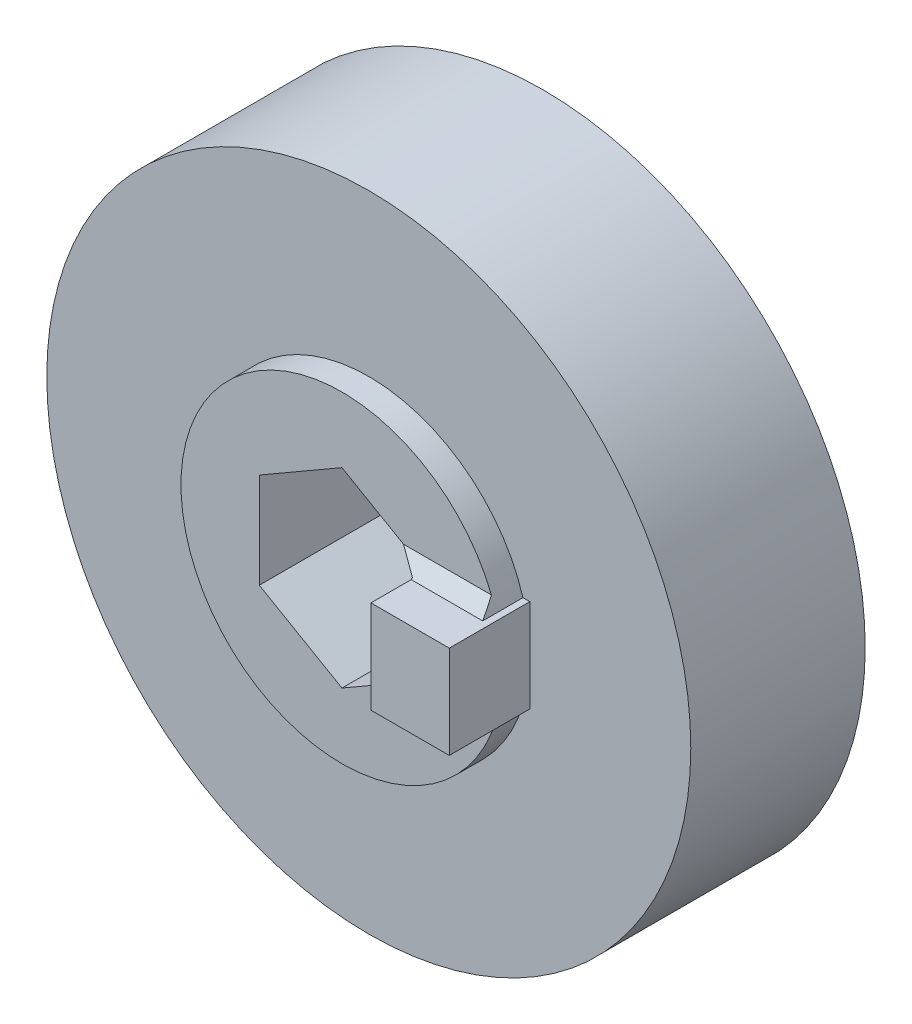
ISO-10303-21;
HEADER;
FILE_DESCRIPTION(('STEP AP214'),'2;1');
FILE_NAME('part.step','',(''),(''),'','','');
FILE_SCHEMA(('AUTOMOTIVE_DESIGN { 1 0 10303 214 1 1 1 1 }'));
ENDSEC;
DATA;
#1=APPLICATION_CONTEXT('core data for automotive mechanical design processes');
#2=APPLICATION_PROTOCOL_DEFINITION('international standard','automotive_design',2000,#1);
#3=PRODUCT_CONTEXT('',#1,'mechanical');
#4=PRODUCT('Part','Part','',(#3));
#5=PRODUCT_RELATED_PRODUCT_CATEGORY('part','',(#4));
#6=PRODUCT_DEFINITION_FORMATION('','',#4);
#7=PRODUCT_DEFINITION_CONTEXT('part definition',#1,'design');
#8=PRODUCT_DEFINITION('design','',#6,#7);
#9=PRODUCT_DEFINITION_SHAPE('','',#8);
#10=(LENGTH_UNIT() NAMED_UNIT(*) SI_UNIT(.MILLI.,.METRE.));
#11=(NAMED_UNIT(*) PLANE_ANGLE_UNIT() SI_UNIT($,.RADIAN.));
#12=(NAMED_UNIT(*) SI_UNIT($,.STERADIAN.) SOLID_ANGLE_UNIT());
#13=UNCERTAINTY_MEASURE_WITH_UNIT(LENGTH_MEASURE(1.E-05),#10,'distance_accuracy_value','');
#14=(GEOMETRIC_REPRESENTATION_CONTEXT(3) GLOBAL_UNCERTAINTY_ASSIGNED_CONTEXT((#13)) GLOBAL_UNIT_ASSIGNED_CONTEXT((#10,
#11,#12)) REPRESENTATION_CONTEXT('',''));
#15=CARTESIAN_POINT('',(0.,0.,0.));
#16=DIRECTION('',(0.,0.,1.));
#17=DIRECTION('',(1.,0.,0.));
#18=AXIS2_PLACEMENT_3D('',#15,#16,#17);
#19=CARTESIAN_POINT('',(3.08,0.,28.8811915483254));
#20=DIRECTION('',(-1.,0.,0.));
#21=DIRECTION('',(0.,0.,1.));
#22=AXIS2_PLACEMENT_3D('',#19,#20,#21);
#23=PLANE('',#22);
#24=DIRECTION('',(0.,0.,-1.));
#25=VECTOR('',#24,1.);
#26=CARTESIAN_POINT('',(3.08,1.77823882910405,28.8811915483254));
#27=LINE('',#26,#25);
#28=CARTESIAN_POINT('',(3.08,1.77823882910405,0.453811978464832));
#29=VERTEX_POINT('',#28);
#30=CARTESIAN_POINT('',(3.08,1.77823882910405,-6.));
#31=VERTEX_POINT('',#30);
#32=EDGE_CURVE('E77',#29,#31,#27,.T.);
#33=ORIENTED_EDGE('',*,*,#32,.T.);
#34=DIRECTION('',(0.,1.,0.));
#35=VECTOR('',#34,1.);
#36=CARTESIAN_POINT('',(3.08,-1.77823882910405,-6.));
#37=LINE('',#36,#35);
#38=CARTESIAN_POINT('',(3.08,-1.77823882910405,-6.));
#39=VERTEX_POINT('',#38);
#40=EDGE_CURVE('E167',#39,#31,#37,.T.);
#41=ORIENTED_EDGE('',*,*,#40,.F.);
#42=DIRECTION('',(0.,0.,1.));
#43=VECTOR('',#42,1.);
#44=CARTESIAN_POINT('',(3.08,-1.77823882910405,-6.));
#45=LINE('',#44,#43);
#46=CARTESIAN_POINT('',(3.08,-1.77823882910405,0.));
#47=VERTEX_POINT('',#46);
#48=EDGE_CURVE('E157',#39,#47,#45,.T.);
#49=ORIENTED_EDGE('',*,*,#48,.T.);
#50=DIRECTION('',(0.,1.,0.));
#51=VECTOR('',#50,1.);
#52=CARTESIAN_POINT('',(3.08,-1.77823882910405,0.));
#53=LINE('',#52,#51);
#54=CARTESIAN_POINT('',(3.08,-1.73205080756887,0.));
#55=VERTEX_POINT('',#54);
#56=EDGE_CURVE('E199',#47,#55,#53,.T.);
#57=ORIENTED_EDGE('',*,*,#56,.T.);
#58=DIRECTION('',(0.,0.,-1.));
#59=VECTOR('',#58,1.);
#60=CARTESIAN_POINT('',(3.08,-1.73205080756887,0.));
#61=LINE('',#60,#59);
#62=CARTESIAN_POINT('',(3.08,-1.73205080756887,2.));
#63=VERTEX_POINT('',#62);
#64=EDGE_CURVE('E270',#63,#55,#61,.T.);
#65=ORIENTED_EDGE('',*,*,#64,.F.);
#66=DIRECTION('',(0.,-1.,0.));
#67=VECTOR('',#66,1.);
#68=CARTESIAN_POINT('',(3.08,-1.73205080756887,2.));
#69=LINE('',#68,#67);
#70=CARTESIAN_POINT('',(3.08,1.73205080756887,2.));
#71=VERTEX_POINT('',#70);
#72=EDGE_CURVE('E228',#71,#63,#69,.T.);
#73=ORIENTED_EDGE('',*,*,#72,.F.);
#74=DIRECTION('',(0.,0.,-1.));
#75=VECTOR('',#74,1.);
#76=CARTESIAN_POINT('',(3.08,1.73205080756887,2.));
#77=LINE('',#76,#75);
#78=CARTESIAN_POINT('',(3.08,1.73205080756887,0.5));
#79=VERTEX_POINT('',#78);
#80=EDGE_CURVE('E232',#71,#79,#77,.T.);
#81=ORIENTED_EDGE('',*,*,#80,.T.);
#82=DIRECTION('',(0.,0.707106781186548,-0.707106781186548));
#83=VECTOR('',#82,1.);
#84=CARTESIAN_POINT('',(3.08,-13.3245703703783,15.5566211779472));
#85=LINE('',#84,#83);
#86=EDGE_CURVE('E281',#29,#79,#85,.F.);
#87=ORIENTED_EDGE('',*,*,#86,.F.);
#88=EDGE_LOOP('',(#33,#41,#49,#57,#65,#73,#81,#87));
#89=FACE_BOUND('',#88,.T.);
#90=ADVANCED_FACE('F52',(#89),#23,.T.);
#91=CARTESIAN_POINT('',(0.,0.,-1.));
#92=DIRECTION('',(0.,0.,1.));
#93=DIRECTION('',(1.,0.,0.));
#94=AXIS2_PLACEMENT_3D('',#91,#92,#93);
#95=CYLINDRICAL_SURFACE('',#94,6.);
#96=DIRECTION('',(0.,0.,1.));
#97=VECTOR('',#96,1.);
#98=CARTESIAN_POINT('',(5.74456264653803,1.73205080756887,-1.));
#99=LINE('',#98,#97);
#100=CARTESIAN_POINT('',(5.74456264653803,1.73205080756887,-1.));
#101=VERTEX_POINT('',#100);
#102=CARTESIAN_POINT('',(5.74456264653803,1.73205080756887,0.5));
#103=VERTEX_POINT('',#102);
#104=EDGE_CURVE('E375',#101,#103,#99,.T.);
#105=ORIENTED_EDGE('',*,*,#104,.F.);
#106=CARTESIAN_POINT('',(0.,0.,-1.));
#107=DIRECTION('',(0.,0.,-1.));
#108=DIRECTION('',(1.,0.,0.));
#109=AXIS2_PLACEMENT_3D('',#106,#107,#108);
#110=CIRCLE('',#109,6.);
#111=CARTESIAN_POINT('',(5.74456264653803,-1.73205080756887,-1.));
#112=VERTEX_POINT('',#111);
#113=EDGE_CURVE('E245',#112,#101,#110,.T.);
#114=ORIENTED_EDGE('',*,*,#113,.F.);
#115=DIRECTION('',(0.,0.,1.));
#116=VECTOR('',#115,1.);
#117=CARTESIAN_POINT('',(5.74456264653803,-1.73205080756887,-1.));
#118=LINE('',#117,#116);
#119=CARTESIAN_POINT('',(5.74456264653803,-1.73205080756887,0.));
#120=VERTEX_POINT('',#119);
#121=EDGE_CURVE('E261',#112,#120,#118,.T.);
#122=ORIENTED_EDGE('',*,*,#121,.T.);
#123=CARTESIAN_POINT('',(0.,0.,0.));
#124=DIRECTION('',(0.,0.,-1.));
#125=DIRECTION('',(1.,0.,0.));
#126=AXIS2_PLACEMENT_3D('',#123,#124,#125);
#127=CIRCLE('',#126,6.);
#128=CARTESIAN_POINT('',(5.56937601463855,2.23205080756887,0.));
#129=VERTEX_POINT('',#128);
#130=EDGE_CURVE('E241',#120,#129,#127,.T.);
#131=ORIENTED_EDGE('',*,*,#130,.T.);
#132=CARTESIAN_POINT('',(0.,0.,2.23205080756888));
#133=DIRECTION('',(0.,0.707106781186548,0.707106781186548));
#134=DIRECTION('',(0.,-0.707106781186548,0.707106781186548));
#135=AXIS2_PLACEMENT_3D('',#132,#133,#134);
#136=ELLIPSE('',#135,8.48528137423857,6.);
#137=EDGE_CURVE('E62',#129,#103,#136,.F.);
#138=ORIENTED_EDGE('',*,*,#137,.T.);
#139=EDGE_LOOP('',(#105,#114,#122,#131,#138));
#140=FACE_BOUND('',#139,.T.);
#141=ADVANCED_FACE('F54',(#140),#95,.T.);
#142=CARTESIAN_POINT('',(1.54,2.66735824365607,28.8811915483254));
#143=DIRECTION('',(-0.5,-0.866025403784439,0.));
#144=DIRECTION('',(0.866025403784439,-0.5,0.));
#145=AXIS2_PLACEMENT_3D('',#142,#143,#144);
#146=PLANE('',#145);
#147=DIRECTION('',(0.774596669241483,-0.447213595499958,0.447213595499958));
#148=VECTOR('',#147,1.);
#149=CARTESIAN_POINT('',(3.964,1.26786119114042,0.96418961642846));
#150=LINE('',#149,#148);
#151=CARTESIAN_POINT('',(2.29397459621557,2.23205080756887,0.));
#152=VERTEX_POINT('',#151);
#153=EDGE_CURVE('E284',#29,#152,#150,.F.);
#154=ORIENTED_EDGE('',*,*,#153,.T.);
#155=DIRECTION('',(-0.866025403784439,0.5,0.));
#156=VECTOR('',#155,1.);
#157=CARTESIAN_POINT('',(1.54,2.66735824365607,0.));
#158=LINE('',#157,#156);
#159=CARTESIAN_POINT('',(0.,3.55647765820809,0.));
#160=VERTEX_POINT('',#159);
#161=EDGE_CURVE('E12',#152,#160,#158,.T.);
#162=ORIENTED_EDGE('',*,*,#161,.T.);
#163=DIRECTION('',(0.,0.,1.));
#164=VECTOR('',#163,1.);
#165=CARTESIAN_POINT('',(0.,3.55647765820809,-6.));
#166=LINE('',#165,#164);
#167=CARTESIAN_POINT('',(0.,3.55647765820809,-6.));
#168=VERTEX_POINT('',#167);
#169=EDGE_CURVE('E212',#168,#160,#166,.T.);
#170=ORIENTED_EDGE('',*,*,#169,.F.);
#171=DIRECTION('',(-0.866025403784439,0.5,0.));
#172=VECTOR('',#171,1.);
#173=CARTESIAN_POINT('',(3.08,1.77823882910405,-6.));
#174=LINE('',#173,#172);
#175=EDGE_CURVE('E185',#31,#168,#174,.T.);
#176=ORIENTED_EDGE('',*,*,#175,.F.);
#177=ORIENTED_EDGE('',*,*,#32,.F.);
#178=EDGE_LOOP('',(#154,#162,#170,#176,#177));
#179=FACE_BOUND('',#178,.T.);
#180=ADVANCED_FACE('F645',(#179),#146,.T.);
#181=CARTESIAN_POINT('',(4.5,1.73205080756887,0.5));
#182=DIRECTION('',(0.,0.707106781186548,0.707106781186548));
#183=DIRECTION('',(1.,0.,0.));
#184=AXIS2_PLACEMENT_3D('',#181,#182,#183);
#185=PLANE('',#184);
#186=DIRECTION('',(1.,0.,0.));
#187=VECTOR('',#186,1.);
#188=CARTESIAN_POINT('',(5.74456264653803,2.23205080756887,0.));
#189=LINE('',#188,#187);
#190=EDGE_CURVE('E290',#152,#129,#189,.T.);
#191=ORIENTED_EDGE('',*,*,#190,.F.);
#192=ORIENTED_EDGE('',*,*,#153,.F.);
#193=ORIENTED_EDGE('',*,*,#86,.T.);
#194=DIRECTION('',(-1.,0.,0.));
#195=VECTOR('',#194,1.);
#196=CARTESIAN_POINT('',(3.,1.73205080756887,0.5));
#197=LINE('',#196,#195);
#198=EDGE_CURVE('E278',#103,#79,#197,.T.);
#199=ORIENTED_EDGE('',*,*,#198,.F.);
#200=ORIENTED_EDGE('',*,*,#137,.F.);
#201=EDGE_LOOP('',(#191,#192,#193,#199,#200));
#202=FACE_BOUND('',#201,.T.);
#203=ADVANCED_FACE('F615',(#202),#185,.T.);
#204=CARTESIAN_POINT('',(6.,-1.73205080756887,0.5));
#205=DIRECTION('',(-1.,0.,0.));
#206=DIRECTION('',(0.,0.,1.));
#207=AXIS2_PLACEMENT_3D('',#204,#205,#206);
#208=PLANE('',#207);
#209=DIRECTION('',(0.,0.,1.));
#210=VECTOR('',#209,1.);
#211=CARTESIAN_POINT('',(6.,1.73205080756887,0.5));
#212=LINE('',#211,#210);
#213=CARTESIAN_POINT('',(6.,1.73205080756887,-1.));
#214=VERTEX_POINT('',#213);
#215=CARTESIAN_POINT('',(6.,1.73205080756887,2.));
#216=VERTEX_POINT('',#215);
#217=EDGE_CURVE('E266',#214,#216,#212,.T.);
#218=ORIENTED_EDGE('',*,*,#217,.T.);
#219=DIRECTION('',(0.,1.,0.));
#220=VECTOR('',#219,1.);
#221=CARTESIAN_POINT('',(6.,1.73205080756887,2.));
#222=LINE('',#221,#220);
#223=CARTESIAN_POINT('',(6.,-1.73205080756887,2.));
#224=VERTEX_POINT('',#223);
#225=EDGE_CURVE('E221',#224,#216,#222,.T.);
#226=ORIENTED_EDGE('',*,*,#225,.F.);
#227=DIRECTION('',(0.,0.,1.));
#228=VECTOR('',#227,1.);
#229=CARTESIAN_POINT('',(6.,-1.73205080756887,0.5));
#230=LINE('',#229,#228);
#231=CARTESIAN_POINT('',(6.,-1.73205080756887,-1.));
#232=VERTEX_POINT('',#231);
#233=EDGE_CURVE('E267',#232,#224,#230,.T.);
#234=ORIENTED_EDGE('',*,*,#233,.F.);
#235=DIRECTION('',(0.,-1.,0.));
#236=VECTOR('',#235,1.);
#237=CARTESIAN_POINT('',(6.,-1.73205080756887,-1.));
#238=LINE('',#237,#236);
#239=EDGE_CURVE('E253',#214,#232,#238,.T.);
#240=ORIENTED_EDGE('',*,*,#239,.F.);
#241=EDGE_LOOP('',(#218,#226,#234,#240));
#242=FACE_BOUND('',#241,.T.);
#243=ADVANCED_FACE('F644',(#242),#208,.F.);
#244=CARTESIAN_POINT('',(0.,-1.73205080756887,0.));
#245=DIRECTION('',(0.,1.,0.));
#246=DIRECTION('',(0.,0.,1.));
#247=AXIS2_PLACEMENT_3D('',#244,#245,#246);
#248=PLANE('',#247);
#249=ORIENTED_EDGE('',*,*,#233,.T.);
#250=DIRECTION('',(1.,0.,0.));
#251=VECTOR('',#250,1.);
#252=CARTESIAN_POINT('',(6.,-1.73205080756887,2.));
#253=LINE('',#252,#251);
#254=EDGE_CURVE('E208',#63,#224,#253,.T.);
#255=ORIENTED_EDGE('',*,*,#254,.F.);
#256=ORIENTED_EDGE('',*,*,#64,.T.);
#257=DIRECTION('',(1.,0.,0.));
#258=VECTOR('',#257,1.);
#259=CARTESIAN_POINT('',(6.,-1.73205080756887,0.));
#260=LINE('',#259,#258);
#261=EDGE_CURVE('E274',#55,#120,#260,.T.);
#262=ORIENTED_EDGE('',*,*,#261,.T.);
#263=ORIENTED_EDGE('',*,*,#121,.F.);
#264=DIRECTION('',(-1.,0.,0.));
#265=VECTOR('',#264,1.);
#266=CARTESIAN_POINT('',(5.74456264653803,-1.73205080756887,-1.));
#267=LINE('',#266,#265);
#268=EDGE_CURVE('E257',#232,#112,#267,.T.);
#269=ORIENTED_EDGE('',*,*,#268,.F.);
#270=EDGE_LOOP('',(#249,#255,#256,#262,#263,#269));
#271=FACE_BOUND('',#270,.T.);
#272=ADVANCED_FACE('F703',(#271),#248,.F.);
#273=CARTESIAN_POINT('',(0.,1.73205080756887,0.));
#274=DIRECTION('',(0.,1.,0.));
#275=DIRECTION('',(0.,0.,1.));
#276=AXIS2_PLACEMENT_3D('',#273,#274,#275);
#277=PLANE('',#276);
#278=ORIENTED_EDGE('',*,*,#217,.F.);
#279=DIRECTION('',(1.,0.,0.));
#280=VECTOR('',#279,1.);
#281=CARTESIAN_POINT('',(6.,1.73205080756887,-1.));
#282=LINE('',#281,#280);
#283=EDGE_CURVE('E249',#101,#214,#282,.T.);
#284=ORIENTED_EDGE('',*,*,#283,.F.);
#285=ORIENTED_EDGE('',*,*,#104,.T.);
#286=ORIENTED_EDGE('',*,*,#198,.T.);
#287=ORIENTED_EDGE('',*,*,#80,.F.);
#288=DIRECTION('',(-1.,0.,0.));
#289=VECTOR('',#288,1.);
#290=CARTESIAN_POINT('',(3.08,1.73205080756887,2.));
#291=LINE('',#290,#289);
#292=EDGE_CURVE('E225',#216,#71,#291,.T.);
#293=ORIENTED_EDGE('',*,*,#292,.F.);
#294=EDGE_LOOP('',(#278,#284,#285,#286,#287,#293));
#295=FACE_BOUND('',#294,.T.);
#296=ADVANCED_FACE('F713',(#295),#277,.T.);
#297=CARTESIAN_POINT('',(0.,0.,0.));
#298=DIRECTION('',(0.,0.,1.));
#299=DIRECTION('',(1.,0.,0.));
#300=AXIS2_PLACEMENT_3D('',#297,#298,#299);
#301=PLANE('',#300);
#302=ORIENTED_EDGE('',*,*,#161,.F.);
#303=ORIENTED_EDGE('',*,*,#190,.T.);
#304=ORIENTED_EDGE('',*,*,#130,.F.);
#305=ORIENTED_EDGE('',*,*,#261,.F.);
#306=ORIENTED_EDGE('',*,*,#56,.F.);
#307=DIRECTION('',(0.866025403784438,0.500000000000001,0.));
#308=VECTOR('',#307,1.);
#309=CARTESIAN_POINT('',(0.,-3.55647765820809,0.));
#310=LINE('',#309,#308);
#311=CARTESIAN_POINT('',(0.,-3.55647765820809,0.));
#312=VERTEX_POINT('',#311);
#313=EDGE_CURVE('E196',#312,#47,#310,.T.);
#314=ORIENTED_EDGE('',*,*,#313,.F.);
#315=DIRECTION('',(0.866025403784438,-0.500000000000001,0.));
#316=VECTOR('',#315,1.);
#317=CARTESIAN_POINT('',(-3.08,-1.77823882910405,0.));
#318=LINE('',#317,#316);
#319=CARTESIAN_POINT('',(-3.08,-1.77823882910405,0.));
#320=VERTEX_POINT('',#319);
#321=EDGE_CURVE('E69',#320,#312,#318,.T.);
#322=ORIENTED_EDGE('',*,*,#321,.F.);
#323=DIRECTION('',(0.,-1.,0.));
#324=VECTOR('',#323,1.);
#325=CARTESIAN_POINT('',(-3.08,1.77823882910405,0.));
#326=LINE('',#325,#324);
#327=CARTESIAN_POINT('',(-3.08,1.77823882910405,0.));
#328=VERTEX_POINT('',#327);
#329=EDGE_CURVE('E173',#328,#320,#326,.T.);
#330=ORIENTED_EDGE('',*,*,#329,.F.);
#331=DIRECTION('',(-0.866025403784439,-0.5,0.));
#332=VECTOR('',#331,1.);
#333=CARTESIAN_POINT('',(0.,3.55647765820809,0.));
#334=LINE('',#333,#332);
#335=EDGE_CURVE('E177',#160,#328,#334,.T.);
#336=ORIENTED_EDGE('',*,*,#335,.F.);
#337=EDGE_LOOP('',(#302,#303,#304,#305,#306,#314,#322,#330,#336));
#338=FACE_BOUND('',#337,.T.);
#339=ADVANCED_FACE('F610',(#338),#301,.T.);
#340=CARTESIAN_POINT('',(0.,0.,-1.));
#341=DIRECTION('',(0.,0.,-1.));
#342=DIRECTION('',(-1.,0.,0.));
#343=AXIS2_PLACEMENT_3D('',#340,#341,#342);
#344=PLANE('',#343);
#345=CARTESIAN_POINT('',(0.,0.,-1.));
#346=DIRECTION('',(0.,0.,1.));
#347=DIRECTION('',(-1.,0.,0.));
#348=AXIS2_PLACEMENT_3D('',#345,#346,#347);
#349=CIRCLE('',#348,12.);
#350=CARTESIAN_POINT('',(-12.,0.,-1.));
#351=VERTEX_POINT('',#350);
#352=EDGE_CURVE('E236',#351,#351,#349,.T.);
#353=ORIENTED_EDGE('',*,*,#352,.T.);
#354=EDGE_LOOP('',(#353));
#355=FACE_BOUND('',#354,.T.);
#356=ORIENTED_EDGE('',*,*,#268,.T.);
#357=ORIENTED_EDGE('',*,*,#113,.T.);
#358=ORIENTED_EDGE('',*,*,#283,.T.);
#359=ORIENTED_EDGE('',*,*,#239,.T.);
#360=EDGE_LOOP('',(#356,#357,#358,#359));
#361=FACE_BOUND('',#360,.T.);
#362=ADVANCED_FACE('F731',(#355,#361),#344,.F.);
#363=CARTESIAN_POINT('',(0.,0.,-7.5));
#364=DIRECTION('',(0.,0.,1.));
#365=DIRECTION('',(1.,0.,0.));
#366=AXIS2_PLACEMENT_3D('',#363,#364,#365);
#367=CYLINDRICAL_SURFACE('',#366,12.);
#368=CARTESIAN_POINT('',(0.,0.,-7.5));
#369=DIRECTION('',(0.,0.,1.));
#370=DIRECTION('',(-1.,0.,0.));
#371=AXIS2_PLACEMENT_3D('',#368,#369,#370);
#372=CIRCLE('',#371,12.);
#373=CARTESIAN_POINT('',(-12.,0.,-7.5));
#374=VERTEX_POINT('',#373);
#375=EDGE_CURVE('E237',#374,#374,#372,.T.);
#376=ORIENTED_EDGE('',*,*,#375,.T.);
#377=EDGE_LOOP('',(#376));
#378=FACE_BOUND('',#377,.T.);
#379=ORIENTED_EDGE('',*,*,#352,.F.);
#380=EDGE_LOOP('',(#379));
#381=FACE_BOUND('',#380,.T.);
#382=ADVANCED_FACE('F740',(#378,#381),#367,.T.);
#383=CARTESIAN_POINT('',(0.,0.,-7.5));
#384=DIRECTION('',(0.,0.,-1.));
#385=DIRECTION('',(-1.,0.,0.));
#386=AXIS2_PLACEMENT_3D('',#383,#384,#385);
#387=PLANE('',#386);
#388=CARTESIAN_POINT('',(-6.,0.,-7.5));
#389=DIRECTION('',(0.,0.,-1.));
#390=DIRECTION('',(-1.,0.,0.));
#391=AXIS2_PLACEMENT_3D('',#388,#389,#390);
#392=CIRCLE('',#391,2.8);
#393=CARTESIAN_POINT('',(-8.8,0.,-7.5));
#394=VERTEX_POINT('',#393);
#395=EDGE_CURVE('E940',#394,#394,#392,.T.);
#396=ORIENTED_EDGE('',*,*,#395,.F.);
#397=EDGE_LOOP('',(#396));
#398=FACE_BOUND('',#397,.T.);
#399=CARTESIAN_POINT('',(6.,0.,-7.5));
#400=DIRECTION('',(0.,0.,-1.));
#401=DIRECTION('',(-1.,0.,0.));
#402=AXIS2_PLACEMENT_3D('',#399,#400,#401);
#403=CIRCLE('',#402,2.8);
#404=CARTESIAN_POINT('',(3.2,0.,-7.5));
#405=VERTEX_POINT('',#404);
#406=EDGE_CURVE('E949',#405,#405,#403,.T.);
#407=ORIENTED_EDGE('',*,*,#406,.F.);
#408=EDGE_LOOP('',(#407));
#409=FACE_BOUND('',#408,.T.);
#410=CARTESIAN_POINT('',(0.,0.,-7.5));
#411=DIRECTION('',(0.,0.,-1.));
#412=DIRECTION('',(-1.,0.,0.));
#413=AXIS2_PLACEMENT_3D('',#410,#411,#412);
#414=CIRCLE('',#413,2.1);
#415=CARTESIAN_POINT('',(-2.1,0.,-7.5));
#416=VERTEX_POINT('',#415);
#417=EDGE_CURVE('E180',#416,#416,#414,.T.);
#418=ORIENTED_EDGE('',*,*,#417,.F.);
#419=EDGE_LOOP('',(#418));
#420=FACE_BOUND('',#419,.T.);
#421=ORIENTED_EDGE('',*,*,#375,.F.);
#422=EDGE_LOOP('',(#421));
#423=FACE_BOUND('',#422,.T.);
#424=ADVANCED_FACE('F750',(#398,#409,#420,#423),#387,.T.);
#425=CARTESIAN_POINT('',(0.,0.,2.));
#426=DIRECTION('',(0.,0.,-1.));
#427=DIRECTION('',(-1.,0.,0.));
#428=AXIS2_PLACEMENT_3D('',#425,#426,#427);
#429=PLANE('',#428);
#430=ORIENTED_EDGE('',*,*,#254,.T.);
#431=ORIENTED_EDGE('',*,*,#225,.T.);
#432=ORIENTED_EDGE('',*,*,#292,.T.);
#433=ORIENTED_EDGE('',*,*,#72,.T.);
#434=EDGE_LOOP('',(#430,#431,#432,#433));
#435=FACE_BOUND('',#434,.T.);
#436=ADVANCED_FACE('F760',(#435),#429,.F.);
#437=CARTESIAN_POINT('',(-3.08,-1.77823882910405,-6.));
#438=DIRECTION('',(-0.500000000000001,-0.866025403784438,0.));
#439=DIRECTION('',(0.866025403784438,-0.500000000000001,0.));
#440=AXIS2_PLACEMENT_3D('',#437,#438,#439);
#441=PLANE('',#440);
#442=ORIENTED_EDGE('',*,*,#321,.T.);
#443=DIRECTION('',(0.,0.,1.));
#444=VECTOR('',#443,1.);
#445=CARTESIAN_POINT('',(0.,-3.55647765820809,-6.));
#446=LINE('',#445,#444);
#447=CARTESIAN_POINT('',(0.,-3.55647765820809,-6.));
#448=VERTEX_POINT('',#447);
#449=EDGE_CURVE('E147',#448,#312,#446,.T.);
#450=ORIENTED_EDGE('',*,*,#449,.F.);
#451=DIRECTION('',(0.866025403784438,-0.500000000000001,0.));
#452=VECTOR('',#451,1.);
#453=CARTESIAN_POINT('',(-3.08,-1.77823882910405,-6.));
#454=LINE('',#453,#452);
#455=CARTESIAN_POINT('',(-3.08,-1.77823882910405,-6.));
#456=VERTEX_POINT('',#455);
#457=EDGE_CURVE('E151',#456,#448,#454,.T.);
#458=ORIENTED_EDGE('',*,*,#457,.F.);
#459=DIRECTION('',(0.,0.,1.));
#460=VECTOR('',#459,1.);
#461=CARTESIAN_POINT('',(-3.08,-1.77823882910405,-6.));
#462=LINE('',#461,#460);
#463=EDGE_CURVE('E205',#456,#320,#462,.T.);
#464=ORIENTED_EDGE('',*,*,#463,.T.);
#465=EDGE_LOOP('',(#442,#450,#458,#464));
#466=FACE_BOUND('',#465,.T.);
#467=ADVANCED_FACE('F149',(#466),#441,.F.);
#468=CARTESIAN_POINT('',(-3.08,1.77823882910405,-6.));
#469=DIRECTION('',(-1.,0.,0.));
#470=DIRECTION('',(0.,0.,1.));
#471=AXIS2_PLACEMENT_3D('',#468,#469,#470);
#472=PLANE('',#471);
#473=ORIENTED_EDGE('',*,*,#329,.T.);
#474=ORIENTED_EDGE('',*,*,#463,.F.);
#475=DIRECTION('',(0.,-1.,0.));
#476=VECTOR('',#475,1.);
#477=CARTESIAN_POINT('',(-3.08,1.77823882910405,-6.));
#478=LINE('',#477,#476);
#479=CARTESIAN_POINT('',(-3.08,1.77823882910405,-6.));
#480=VERTEX_POINT('',#479);
#481=EDGE_CURVE('E158',#480,#456,#478,.T.);
#482=ORIENTED_EDGE('',*,*,#481,.F.);
#483=DIRECTION('',(0.,0.,1.));
#484=VECTOR('',#483,1.);
#485=CARTESIAN_POINT('',(-3.08,1.77823882910405,-6.));
#486=LINE('',#485,#484);
#487=EDGE_CURVE('E209',#480,#328,#486,.T.);
#488=ORIENTED_EDGE('',*,*,#487,.T.);
#489=EDGE_LOOP('',(#473,#474,#482,#488));
#490=FACE_BOUND('',#489,.T.);
#491=ADVANCED_FACE('F779',(#490),#472,.F.);
#492=CARTESIAN_POINT('',(0.,3.55647765820809,-6.));
#493=DIRECTION('',(-0.5,0.866025403784439,0.));
#494=DIRECTION('',(-0.866025403784439,-0.5,0.));
#495=AXIS2_PLACEMENT_3D('',#492,#493,#494);
#496=PLANE('',#495);
#497=ORIENTED_EDGE('',*,*,#335,.T.);
#498=ORIENTED_EDGE('',*,*,#487,.F.);
#499=DIRECTION('',(-0.866025403784439,-0.5,0.));
#500=VECTOR('',#499,1.);
#501=CARTESIAN_POINT('',(0.,3.55647765820809,-6.));
#502=LINE('',#501,#500);
#503=EDGE_CURVE('E189',#168,#480,#502,.T.);
#504=ORIENTED_EDGE('',*,*,#503,.F.);
#505=ORIENTED_EDGE('',*,*,#169,.T.);
#506=EDGE_LOOP('',(#497,#498,#504,#505));
#507=FACE_BOUND('',#506,.T.);
#508=ADVANCED_FACE('F788',(#507),#496,.F.);
#509=CARTESIAN_POINT('',(0.,-3.55647765820809,-6.));
#510=DIRECTION('',(0.500000000000001,-0.866025403784438,0.));
#511=DIRECTION('',(0.866025403784438,0.500000000000001,0.));
#512=AXIS2_PLACEMENT_3D('',#509,#510,#511);
#513=PLANE('',#512);
#514=ORIENTED_EDGE('',*,*,#313,.T.);
#515=ORIENTED_EDGE('',*,*,#48,.F.);
#516=DIRECTION('',(0.866025403784438,0.500000000000001,0.));
#517=VECTOR('',#516,1.);
#518=CARTESIAN_POINT('',(0.,-3.55647765820809,-6.));
#519=LINE('',#518,#517);
#520=EDGE_CURVE('E161',#448,#39,#519,.T.);
#521=ORIENTED_EDGE('',*,*,#520,.F.);
#522=ORIENTED_EDGE('',*,*,#449,.T.);
#523=EDGE_LOOP('',(#514,#515,#521,#522));
#524=FACE_BOUND('',#523,.T.);
#525=ADVANCED_FACE('F162',(#524),#513,.F.);
#526=CARTESIAN_POINT('',(0.,0.,-6.));
#527=DIRECTION('',(0.,0.,1.));
#528=DIRECTION('',(1.,0.,0.));
#529=AXIS2_PLACEMENT_3D('',#526,#527,#528);
#530=PLANE('',#529);
#531=CARTESIAN_POINT('',(0.,0.,-6.));
#532=DIRECTION('',(0.,0.,1.));
#533=DIRECTION('',(1.,0.,0.));
#534=AXIS2_PLACEMENT_3D('',#531,#532,#533);
#535=CIRCLE('',#534,2.1);
#536=CARTESIAN_POINT('',(2.1,0.,-6.));
#537=VERTEX_POINT('',#536);
#538=EDGE_CURVE('E56',#537,#537,#535,.T.);
#539=ORIENTED_EDGE('',*,*,#538,.F.);
#540=EDGE_LOOP('',(#539));
#541=FACE_BOUND('',#540,.T.);
#542=ORIENTED_EDGE('',*,*,#457,.T.);
#543=ORIENTED_EDGE('',*,*,#520,.T.);
#544=ORIENTED_EDGE('',*,*,#40,.T.);
#545=ORIENTED_EDGE('',*,*,#175,.T.);
#546=ORIENTED_EDGE('',*,*,#503,.T.);
#547=ORIENTED_EDGE('',*,*,#481,.T.);
#548=EDGE_LOOP('',(#542,#543,#544,#545,#546,#547));
#549=FACE_BOUND('',#548,.T.);
#550=ADVANCED_FACE('F169',(#541,#549),#530,.T.);
#551=CARTESIAN_POINT('',(0.,0.,-2.5));
#552=DIRECTION('',(0.,0.,-1.));
#553=DIRECTION('',(-1.,0.,0.));
#554=AXIS2_PLACEMENT_3D('',#551,#552,#553);
#555=CYLINDRICAL_SURFACE('',#554,2.1);
#556=ORIENTED_EDGE('',*,*,#538,.T.);
#557=EDGE_LOOP('',(#556));
#558=FACE_BOUND('',#557,.T.);
#559=ORIENTED_EDGE('',*,*,#417,.T.);
#560=EDGE_LOOP('',(#559));
#561=FACE_BOUND('',#560,.T.);
#562=ADVANCED_FACE('F815',(#558,#561),#555,.F.);
#563=CARTESIAN_POINT('',(6.,0.,-2.5));
#564=DIRECTION('',(0.,0.,-1.));
#565=DIRECTION('',(-1.,0.,0.));
#566=AXIS2_PLACEMENT_3D('',#563,#564,#565);
#567=CYLINDRICAL_SURFACE('',#566,2.8);
#568=CARTESIAN_POINT('',(6.,0.,-2.5));
#569=DIRECTION('',(0.,0.,-1.));
#570=DIRECTION('',(-1.,0.,0.));
#571=AXIS2_PLACEMENT_3D('',#568,#569,#570);
#572=CIRCLE('',#571,2.8);
#573=CARTESIAN_POINT('',(3.2,0.,-2.5));
#574=VERTEX_POINT('',#573);
#575=EDGE_CURVE('E943',#574,#574,#572,.T.);
#576=ORIENTED_EDGE('',*,*,#575,.F.);
#577=EDGE_LOOP('',(#576));
#578=FACE_BOUND('',#577,.T.);
#579=ORIENTED_EDGE('',*,*,#406,.T.);
#580=EDGE_LOOP('',(#579));
#581=FACE_BOUND('',#580,.T.);
#582=ADVANCED_FACE('F825',(#578,#581),#567,.F.);
#583=CARTESIAN_POINT('',(6.,0.,-2.5));
#584=DIRECTION('',(0.,0.,-1.));
#585=DIRECTION('',(-1.,0.,0.));
#586=AXIS2_PLACEMENT_3D('',#583,#584,#585);
#587=PLANE('',#586);
#588=ORIENTED_EDGE('',*,*,#575,.T.);
#589=EDGE_LOOP('',(#588));
#590=FACE_BOUND('',#589,.T.);
#591=ADVANCED_FACE('F835',(#590),#587,.T.);
#592=CARTESIAN_POINT('',(-6.,0.,-2.5));
#593=DIRECTION('',(0.,0.,-1.));
#594=DIRECTION('',(-1.,0.,0.));
#595=AXIS2_PLACEMENT_3D('',#592,#593,#594);
#596=CYLINDRICAL_SURFACE('',#595,2.8);
#597=CARTESIAN_POINT('',(-6.,0.,-2.5));
#598=DIRECTION('',(0.,0.,-1.));
#599=DIRECTION('',(-1.,0.,0.));
#600=AXIS2_PLACEMENT_3D('',#597,#598,#599);
#601=CIRCLE('',#600,2.8);
#602=CARTESIAN_POINT('',(-8.8,0.,-2.5));
#603=VERTEX_POINT('',#602);
#604=EDGE_CURVE('E938',#603,#603,#601,.T.);
#605=ORIENTED_EDGE('',*,*,#604,.F.);
#606=EDGE_LOOP('',(#605));
#607=FACE_BOUND('',#606,.T.);
#608=ORIENTED_EDGE('',*,*,#395,.T.);
#609=EDGE_LOOP('',(#608));
#610=FACE_BOUND('',#609,.T.);
#611=ADVANCED_FACE('F845',(#607,#610),#596,.F.);
#612=CARTESIAN_POINT('',(-6.,0.,-2.5));
#613=DIRECTION('',(0.,0.,-1.));
#614=DIRECTION('',(-1.,0.,0.));
#615=AXIS2_PLACEMENT_3D('',#612,#613,#614);
#616=PLANE('',#615);
#617=ORIENTED_EDGE('',*,*,#604,.T.);
#618=EDGE_LOOP('',(#617));
#619=FACE_BOUND('',#618,.T.);
#620=ADVANCED_FACE('F855',(#619),#616,.T.);
#621=CLOSED_SHELL('',(#90,#141,#180,#203,#243,#272,#296,#339,#362,#382,#424,#436,#467,#491,#508,
#525,#550,#562,#582,#591,#611,#620));
#622=MANIFOLD_SOLID_BREP('B2',#621);
#623=ADVANCED_BREP_SHAPE_REPRESENTATION('',(#18,#622),#14);
#624=SHAPE_DEFINITION_REPRESENTATION(#9,#623);
ENDSEC;
END-ISO-10303-21;
